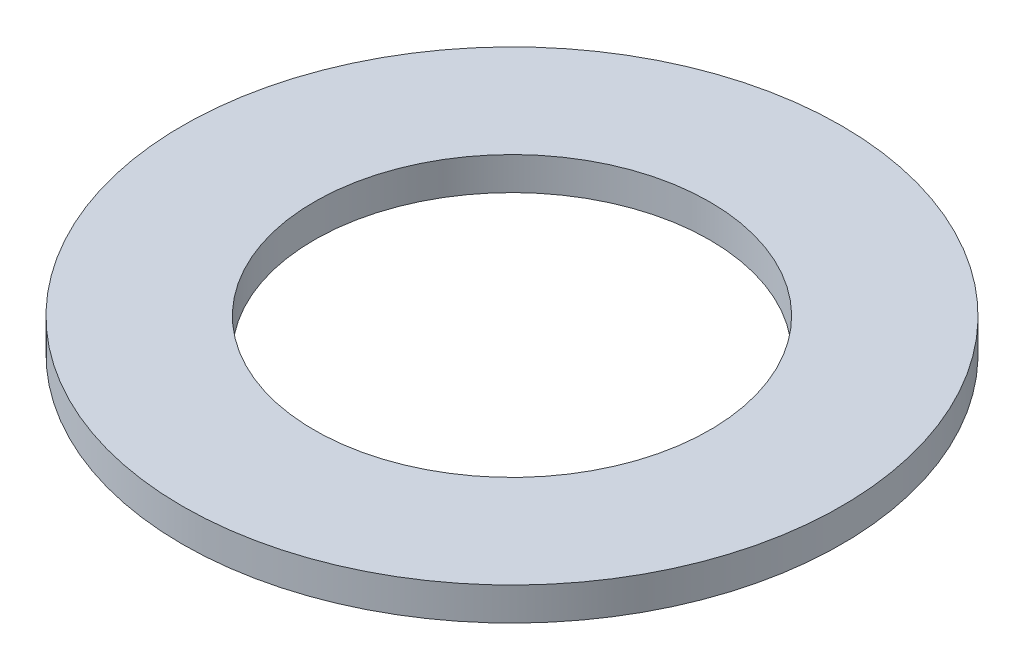
ISO-10303-21;
HEADER;
FILE_DESCRIPTION(('STEP AP214'),'2;1');
FILE_NAME('part.step','',(''),(''),'','','');
FILE_SCHEMA(('AUTOMOTIVE_DESIGN { 1 0 10303 214 1 1 1 1 }'));
ENDSEC;
DATA;
#1=APPLICATION_CONTEXT('core data for automotive mechanical design processes');
#2=APPLICATION_PROTOCOL_DEFINITION('international standard','automotive_design',2000,#1);
#3=PRODUCT_CONTEXT('',#1,'mechanical');
#4=PRODUCT('Part','Part','',(#3));
#5=PRODUCT_RELATED_PRODUCT_CATEGORY('part','',(#4));
#6=PRODUCT_DEFINITION_FORMATION('','',#4);
#7=PRODUCT_DEFINITION_CONTEXT('part definition',#1,'design');
#8=PRODUCT_DEFINITION('design','',#6,#7);
#9=PRODUCT_DEFINITION_SHAPE('','',#8);
#10=(LENGTH_UNIT() NAMED_UNIT(*) SI_UNIT(.MILLI.,.METRE.));
#11=(NAMED_UNIT(*) PLANE_ANGLE_UNIT() SI_UNIT($,.RADIAN.));
#12=(NAMED_UNIT(*) SI_UNIT($,.STERADIAN.) SOLID_ANGLE_UNIT());
#13=UNCERTAINTY_MEASURE_WITH_UNIT(LENGTH_MEASURE(1.E-05),#10,'distance_accuracy_value','');
#14=(GEOMETRIC_REPRESENTATION_CONTEXT(3) GLOBAL_UNCERTAINTY_ASSIGNED_CONTEXT((#13)) GLOBAL_UNIT_ASSIGNED_CONTEXT((#10,
#11,#12)) REPRESENTATION_CONTEXT('',''));
#15=CARTESIAN_POINT('',(0.,0.,0.));
#16=DIRECTION('',(0.,0.,1.));
#17=DIRECTION('',(1.,0.,0.));
#18=AXIS2_PLACEMENT_3D('',#15,#16,#17);
#19=CARTESIAN_POINT('',(0.,0.,0.));
#20=DIRECTION('',(0.,-1.,0.));
#21=DIRECTION('',(0.,0.,-1.));
#22=AXIS2_PLACEMENT_3D('',#19,#20,#21);
#23=CYLINDRICAL_SURFACE('',#22,2.38125);
#24=CARTESIAN_POINT('',(0.,0.396875,0.));
#25=DIRECTION('',(0.,-1.,0.));
#26=DIRECTION('',(0.,0.,-1.));
#27=AXIS2_PLACEMENT_3D('',#24,#25,#26);
#28=CIRCLE('',#27,2.38125);
#29=CARTESIAN_POINT('',(0.,0.396875,-2.38125));
#30=VERTEX_POINT('',#29);
#31=EDGE_CURVE('E10',#30,#30,#28,.T.);
#32=ORIENTED_EDGE('',*,*,#31,.F.);
#33=EDGE_LOOP('',(#32));
#34=FACE_BOUND('',#33,.T.);
#35=CARTESIAN_POINT('',(0.,0.,0.));
#36=DIRECTION('',(0.,-1.,0.));
#37=DIRECTION('',(0.,0.,-1.));
#38=AXIS2_PLACEMENT_3D('',#35,#36,#37);
#39=CIRCLE('',#38,2.38125);
#40=CARTESIAN_POINT('',(0.,0.,-2.38125));
#41=VERTEX_POINT('',#40);
#42=EDGE_CURVE('E56',#41,#41,#39,.T.);
#43=ORIENTED_EDGE('',*,*,#42,.T.);
#44=EDGE_LOOP('',(#43));
#45=FACE_BOUND('',#44,.T.);
#46=ADVANCED_FACE('F39',(#34,#45),#23,.F.);
#47=CARTESIAN_POINT('',(-2.38125,0.396875,0.));
#48=DIRECTION('',(0.,-1.,0.));
#49=DIRECTION('',(0.,0.,-1.));
#50=AXIS2_PLACEMENT_3D('',#47,#48,#49);
#51=PLANE('',#50);
#52=CARTESIAN_POINT('',(0.,0.396874999999999,0.));
#53=DIRECTION('',(0.,-1.,0.));
#54=DIRECTION('',(0.,0.,-1.));
#55=AXIS2_PLACEMENT_3D('',#52,#53,#54);
#56=CIRCLE('',#55,3.96875);
#57=CARTESIAN_POINT('',(0.,0.396874999999999,-3.96875));
#58=VERTEX_POINT('',#57);
#59=EDGE_CURVE('E46',#58,#58,#56,.T.);
#60=ORIENTED_EDGE('',*,*,#59,.F.);
#61=EDGE_LOOP('',(#60));
#62=FACE_BOUND('',#61,.T.);
#63=ORIENTED_EDGE('',*,*,#31,.T.);
#64=EDGE_LOOP('',(#63));
#65=FACE_BOUND('',#64,.T.);
#66=ADVANCED_FACE('F72',(#62,#65),#51,.F.);
#67=CARTESIAN_POINT('',(0.,0.,0.));
#68=DIRECTION('',(0.,-1.,0.));
#69=DIRECTION('',(0.,0.,-1.));
#70=AXIS2_PLACEMENT_3D('',#67,#68,#69);
#71=CYLINDRICAL_SURFACE('',#70,3.96875);
#72=CARTESIAN_POINT('',(0.,0.,0.));
#73=DIRECTION('',(0.,-1.,0.));
#74=DIRECTION('',(0.,0.,-1.));
#75=AXIS2_PLACEMENT_3D('',#72,#73,#74);
#76=CIRCLE('',#75,3.96875);
#77=CARTESIAN_POINT('',(0.,0.,-3.96875));
#78=VERTEX_POINT('',#77);
#79=EDGE_CURVE('E51',#78,#78,#76,.T.);
#80=ORIENTED_EDGE('',*,*,#79,.F.);
#81=EDGE_LOOP('',(#80));
#82=FACE_BOUND('',#81,.T.);
#83=ORIENTED_EDGE('',*,*,#59,.T.);
#84=EDGE_LOOP('',(#83));
#85=FACE_BOUND('',#84,.T.);
#86=ADVANCED_FACE('F67',(#82,#85),#71,.T.);
#87=CARTESIAN_POINT('',(-2.38125,0.,0.));
#88=DIRECTION('',(0.,1.,0.));
#89=DIRECTION('',(0.,0.,1.));
#90=AXIS2_PLACEMENT_3D('',#87,#88,#89);
#91=PLANE('',#90);
#92=ORIENTED_EDGE('',*,*,#42,.F.);
#93=EDGE_LOOP('',(#92));
#94=FACE_BOUND('',#93,.T.);
#95=ORIENTED_EDGE('',*,*,#79,.T.);
#96=EDGE_LOOP('',(#95));
#97=FACE_BOUND('',#96,.T.);
#98=ADVANCED_FACE('F64',(#94,#97),#91,.F.);
#99=CLOSED_SHELL('',(#46,#66,#86,#98));
#100=MANIFOLD_SOLID_BREP('B2',#99);
#101=ADVANCED_BREP_SHAPE_REPRESENTATION('',(#18,#100),#14);
#102=SHAPE_DEFINITION_REPRESENTATION(#9,#101);
ENDSEC;
END-ISO-10303-21;
